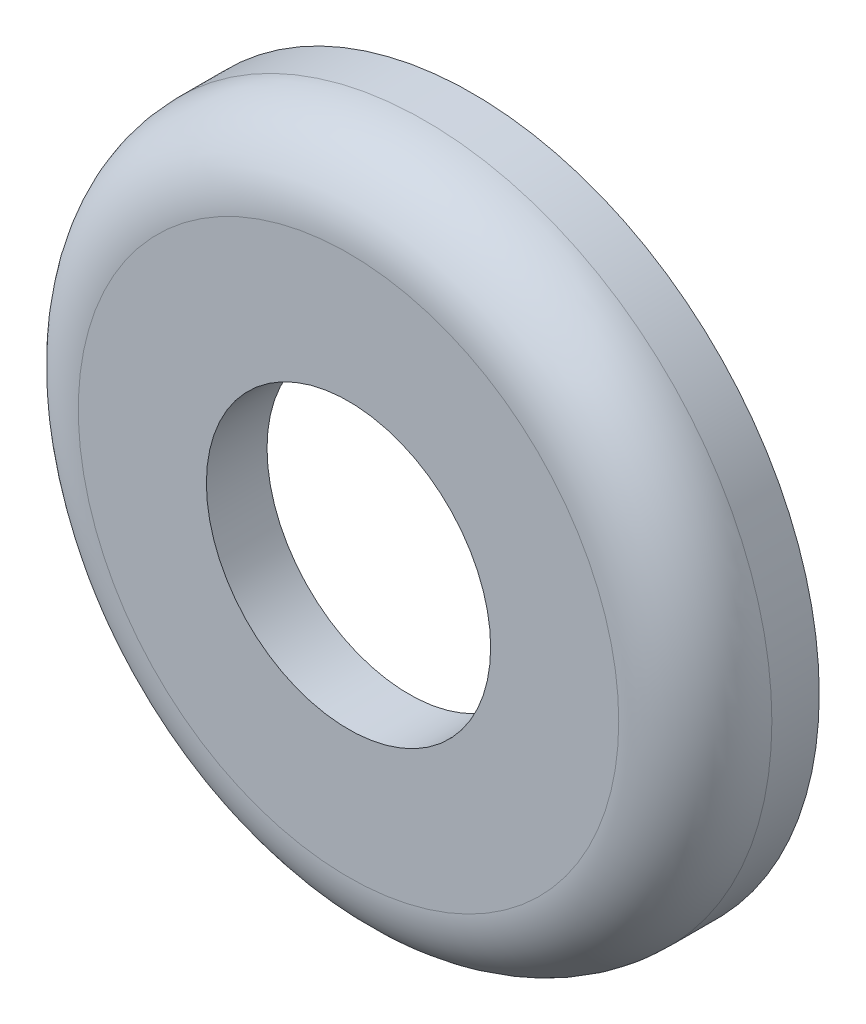
ISO-10303-21;
HEADER;
FILE_DESCRIPTION(('STEP AP214'),'2;1');
FILE_NAME('part.step','',(''),(''),'','','');
FILE_SCHEMA(('AUTOMOTIVE_DESIGN { 1 0 10303 214 1 1 1 1 }'));
ENDSEC;
DATA;
#1=APPLICATION_CONTEXT('core data for automotive mechanical design processes');
#2=APPLICATION_PROTOCOL_DEFINITION('international standard','automotive_design',2000,#1);
#3=PRODUCT_CONTEXT('',#1,'mechanical');
#4=PRODUCT('Part','Part','',(#3));
#5=PRODUCT_RELATED_PRODUCT_CATEGORY('part','',(#4));
#6=PRODUCT_DEFINITION_FORMATION('','',#4);
#7=PRODUCT_DEFINITION_CONTEXT('part definition',#1,'design');
#8=PRODUCT_DEFINITION('design','',#6,#7);
#9=PRODUCT_DEFINITION_SHAPE('','',#8);
#10=(LENGTH_UNIT() NAMED_UNIT(*) SI_UNIT(.MILLI.,.METRE.));
#11=(NAMED_UNIT(*) PLANE_ANGLE_UNIT() SI_UNIT($,.RADIAN.));
#12=(NAMED_UNIT(*) SI_UNIT($,.STERADIAN.) SOLID_ANGLE_UNIT());
#13=UNCERTAINTY_MEASURE_WITH_UNIT(LENGTH_MEASURE(1.E-05),#10,'distance_accuracy_value','');
#14=(GEOMETRIC_REPRESENTATION_CONTEXT(3) GLOBAL_UNCERTAINTY_ASSIGNED_CONTEXT((#13)) GLOBAL_UNIT_ASSIGNED_CONTEXT((#10,
#11,#12)) REPRESENTATION_CONTEXT('',''));
#15=CARTESIAN_POINT('',(0.,0.,0.));
#16=DIRECTION('',(0.,0.,1.));
#17=DIRECTION('',(1.,0.,0.));
#18=AXIS2_PLACEMENT_3D('',#15,#16,#17);
#19=CARTESIAN_POINT('',(0.,0.,-2.428875));
#20=DIRECTION('',(0.,0.,1.));
#21=DIRECTION('',(1.,0.,0.));
#22=AXIS2_PLACEMENT_3D('',#19,#20,#21);
#23=TOROIDAL_SURFACE('',#22,9.04875,0.396875);
#24=CARTESIAN_POINT('',(0.,0.,-2.30498263586609));
#25=DIRECTION('',(0.,0.,1.));
#26=DIRECTION('',(1.,0.,0.));
#27=AXIS2_PLACEMENT_3D('',#24,#25,#26);
#28=CIRCLE('',#27,9.4257917055636);
#29=CARTESIAN_POINT('',(9.4257917055636,0.,-2.30498263586609));
#30=VERTEX_POINT('',#29);
#31=EDGE_CURVE('E62',#30,#30,#28,.T.);
#32=ORIENTED_EDGE('',*,*,#31,.F.);
#33=EDGE_LOOP('',(#32));
#34=FACE_BOUND('',#33,.T.);
#35=CARTESIAN_POINT('',(0.,0.,-2.032));
#36=DIRECTION('',(0.,0.,1.));
#37=DIRECTION('',(1.,0.,0.));
#38=AXIS2_PLACEMENT_3D('',#35,#36,#37);
#39=CIRCLE('',#38,9.04875);
#40=CARTESIAN_POINT('',(9.04875,0.,-2.032));
#41=VERTEX_POINT('',#40);
#42=EDGE_CURVE('E10',#41,#41,#39,.T.);
#43=ORIENTED_EDGE('',*,*,#42,.T.);
#44=EDGE_LOOP('',(#43));
#45=FACE_BOUND('',#44,.T.);
#46=ADVANCED_FACE('F34',(#34,#45),#23,.F.);
#47=CARTESIAN_POINT('',(0.,0.,-2.032));
#48=DIRECTION('',(0.,0.,1.));
#49=DIRECTION('',(1.,0.,0.));
#50=AXIS2_PLACEMENT_3D('',#47,#48,#49);
#51=PLANE('',#50);
#52=ORIENTED_EDGE('',*,*,#42,.F.);
#53=EDGE_LOOP('',(#52));
#54=FACE_BOUND('',#53,.T.);
#55=CARTESIAN_POINT('',(0.,0.,-2.032));
#56=DIRECTION('',(0.,0.,1.));
#57=DIRECTION('',(1.,0.,0.));
#58=AXIS2_PLACEMENT_3D('',#55,#56,#57);
#59=CIRCLE('',#58,4.7625);
#60=CARTESIAN_POINT('',(4.7625,0.,-2.032));
#61=VERTEX_POINT('',#60);
#62=EDGE_CURVE('E40',#61,#61,#59,.T.);
#63=ORIENTED_EDGE('',*,*,#62,.T.);
#64=EDGE_LOOP('',(#63));
#65=FACE_BOUND('',#64,.T.);
#66=ADVANCED_FACE('F70',(#54,#65),#51,.F.);
#67=CARTESIAN_POINT('',(0.,0.,0.));
#68=DIRECTION('',(0.,0.,1.));
#69=DIRECTION('',(1.,0.,0.));
#70=AXIS2_PLACEMENT_3D('',#67,#68,#69);
#71=CYLINDRICAL_SURFACE('',#70,4.7625);
#72=CARTESIAN_POINT('',(0.,0.,0.));
#73=DIRECTION('',(0.,0.,1.));
#74=DIRECTION('',(1.,0.,0.));
#75=AXIS2_PLACEMENT_3D('',#72,#73,#74);
#76=CIRCLE('',#75,4.7625);
#77=CARTESIAN_POINT('',(4.7625,0.,0.));
#78=VERTEX_POINT('',#77);
#79=EDGE_CURVE('E44',#78,#78,#76,.T.);
#80=ORIENTED_EDGE('',*,*,#79,.T.);
#81=EDGE_LOOP('',(#80));
#82=FACE_BOUND('',#81,.T.);
#83=ORIENTED_EDGE('',*,*,#62,.F.);
#84=EDGE_LOOP('',(#83));
#85=FACE_BOUND('',#84,.T.);
#86=ADVANCED_FACE('F74',(#82,#85),#71,.F.);
#87=CARTESIAN_POINT('',(0.,0.,0.));
#88=DIRECTION('',(0.,0.,1.));
#89=DIRECTION('',(1.,0.,0.));
#90=AXIS2_PLACEMENT_3D('',#87,#88,#89);
#91=PLANE('',#90);
#92=CARTESIAN_POINT('',(0.,0.,0.));
#93=DIRECTION('',(0.,0.,1.));
#94=DIRECTION('',(1.,0.,0.));
#95=AXIS2_PLACEMENT_3D('',#92,#93,#94);
#96=CIRCLE('',#95,9.0551);
#97=CARTESIAN_POINT('',(9.0551,0.,0.));
#98=VERTEX_POINT('',#97);
#99=EDGE_CURVE('E48',#98,#98,#96,.T.);
#100=ORIENTED_EDGE('',*,*,#99,.T.);
#101=EDGE_LOOP('',(#100));
#102=FACE_BOUND('',#101,.T.);
#103=ORIENTED_EDGE('',*,*,#79,.F.);
#104=EDGE_LOOP('',(#103));
#105=FACE_BOUND('',#104,.T.);
#106=ADVANCED_FACE('F79',(#102,#105),#91,.T.);
#107=CARTESIAN_POINT('',(0.,0.,-2.5654));
#108=DIRECTION('',(0.,0.,1.));
#109=DIRECTION('',(1.,0.,0.));
#110=AXIS2_PLACEMENT_3D('',#107,#108,#109);
#111=TOROIDAL_SURFACE('',#110,9.0551,2.5654);
#112=CARTESIAN_POINT('',(0.,0.,-2.5654));
#113=DIRECTION('',(0.,0.,1.));
#114=DIRECTION('',(1.,0.,0.));
#115=AXIS2_PLACEMENT_3D('',#112,#113,#114);
#116=CIRCLE('',#115,11.6205);
#117=CARTESIAN_POINT('',(11.6205,0.,-2.5654));
#118=VERTEX_POINT('',#117);
#119=EDGE_CURVE('E53',#118,#118,#116,.T.);
#120=ORIENTED_EDGE('',*,*,#119,.T.);
#121=EDGE_LOOP('',(#120));
#122=FACE_BOUND('',#121,.T.);
#123=ORIENTED_EDGE('',*,*,#99,.F.);
#124=EDGE_LOOP('',(#123));
#125=FACE_BOUND('',#124,.T.);
#126=ADVANCED_FACE('F85',(#122,#125),#111,.T.);
#127=CARTESIAN_POINT('',(0.,0.,0.));
#128=DIRECTION('',(0.,0.,1.));
#129=DIRECTION('',(1.,0.,0.));
#130=AXIS2_PLACEMENT_3D('',#127,#128,#129);
#131=CYLINDRICAL_SURFACE('',#130,11.6205);
#132=CARTESIAN_POINT('',(0.,0.,-4.1529));
#133=DIRECTION('',(0.,0.,1.));
#134=DIRECTION('',(1.,0.,0.));
#135=AXIS2_PLACEMENT_3D('',#132,#133,#134);
#136=CIRCLE('',#135,11.6205);
#137=CARTESIAN_POINT('',(11.6205,0.,-4.1529));
#138=VERTEX_POINT('',#137);
#139=EDGE_CURVE('E56',#138,#138,#136,.T.);
#140=ORIENTED_EDGE('',*,*,#139,.T.);
#141=EDGE_LOOP('',(#140));
#142=FACE_BOUND('',#141,.T.);
#143=ORIENTED_EDGE('',*,*,#119,.F.);
#144=EDGE_LOOP('',(#143));
#145=FACE_BOUND('',#144,.T.);
#146=ADVANCED_FACE('F89',(#142,#145),#131,.T.);
#147=CARTESIAN_POINT('',(0.,0.,-4.1529));
#148=DIRECTION('',(0.,0.,-1.));
#149=DIRECTION('',(-1.,0.,0.));
#150=AXIS2_PLACEMENT_3D('',#147,#148,#149);
#151=PLANE('',#150);
#152=CARTESIAN_POINT('',(0.,0.,-4.1529));
#153=DIRECTION('',(0.,0.,1.));
#154=DIRECTION('',(1.,0.,0.));
#155=AXIS2_PLACEMENT_3D('',#152,#153,#154);
#156=CIRCLE('',#155,10.033);
#157=CARTESIAN_POINT('',(10.033,0.,-4.1529));
#158=VERTEX_POINT('',#157);
#159=EDGE_CURVE('E59',#158,#158,#156,.T.);
#160=ORIENTED_EDGE('',*,*,#159,.T.);
#161=EDGE_LOOP('',(#160));
#162=FACE_BOUND('',#161,.T.);
#163=ORIENTED_EDGE('',*,*,#139,.F.);
#164=EDGE_LOOP('',(#163));
#165=FACE_BOUND('',#164,.T.);
#166=ADVANCED_FACE('F93',(#162,#165),#151,.T.);
#167=CARTESIAN_POINT('',(0.,0.,-4.1529));
#168=DIRECTION('',(0.,0.,-1.));
#169=DIRECTION('',(-1.,0.,0.));
#170=AXIS2_PLACEMENT_3D('',#167,#168,#169);
#171=CONICAL_SURFACE('',#170,10.033,0.317476047809469);
#172=ORIENTED_EDGE('',*,*,#31,.T.);
#173=EDGE_LOOP('',(#172));
#174=FACE_BOUND('',#173,.T.);
#175=ORIENTED_EDGE('',*,*,#159,.F.);
#176=EDGE_LOOP('',(#175));
#177=FACE_BOUND('',#176,.T.);
#178=ADVANCED_FACE('F66',(#174,#177),#171,.F.);
#179=CLOSED_SHELL('',(#46,#66,#86,#106,#126,#146,#166,#178));
#180=MANIFOLD_SOLID_BREP('B2',#179);
#181=ADVANCED_BREP_SHAPE_REPRESENTATION('',(#18,#180),#14);
#182=SHAPE_DEFINITION_REPRESENTATION(#9,#181);
ENDSEC;
END-ISO-10303-21;
